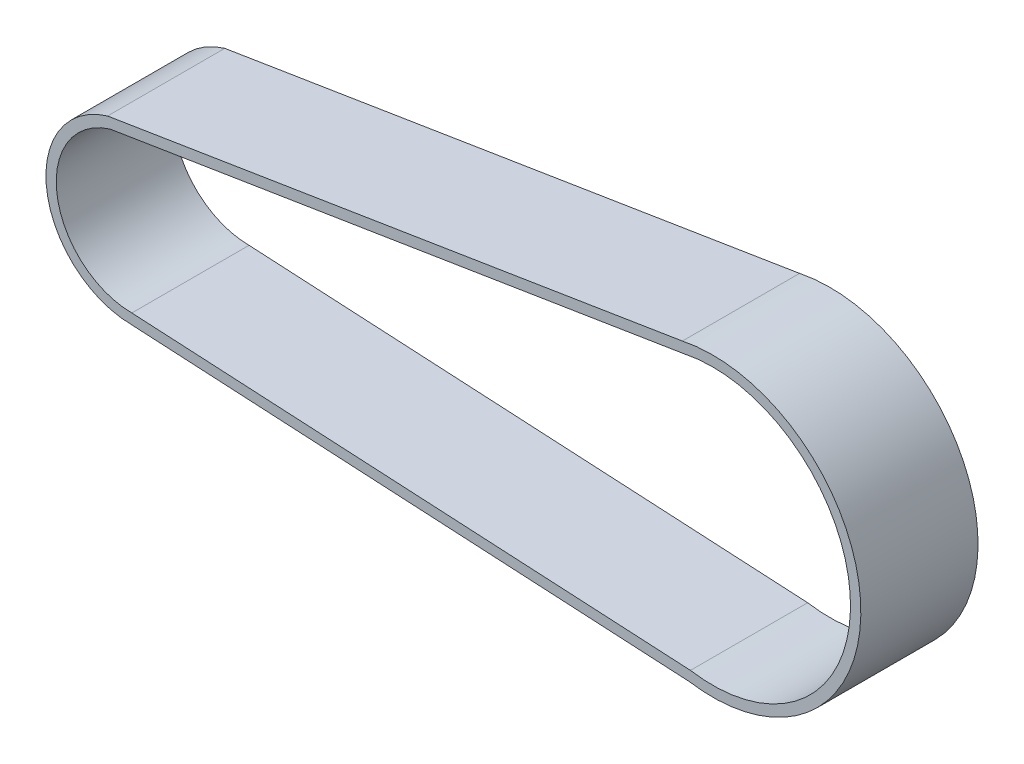
ISO-10303-21;
HEADER;
FILE_DESCRIPTION(('STEP AP214'),'2;1');
FILE_NAME('part.step','',(''),(''),'','','');
FILE_SCHEMA(('AUTOMOTIVE_DESIGN { 1 0 10303 214 1 1 1 1 }'));
ENDSEC;
DATA;
#1=APPLICATION_CONTEXT('core data for automotive mechanical design processes');
#2=APPLICATION_PROTOCOL_DEFINITION('international standard','automotive_design',2000,#1);
#3=PRODUCT_CONTEXT('',#1,'mechanical');
#4=PRODUCT('Part','Part','',(#3));
#5=PRODUCT_RELATED_PRODUCT_CATEGORY('part','',(#4));
#6=PRODUCT_DEFINITION_FORMATION('','',#4);
#7=PRODUCT_DEFINITION_CONTEXT('part definition',#1,'design');
#8=PRODUCT_DEFINITION('design','',#6,#7);
#9=PRODUCT_DEFINITION_SHAPE('','',#8);
#10=(LENGTH_UNIT() NAMED_UNIT(*) SI_UNIT(.MILLI.,.METRE.));
#11=(NAMED_UNIT(*) PLANE_ANGLE_UNIT() SI_UNIT($,.RADIAN.));
#12=(NAMED_UNIT(*) SI_UNIT($,.STERADIAN.) SOLID_ANGLE_UNIT());
#13=UNCERTAINTY_MEASURE_WITH_UNIT(LENGTH_MEASURE(1.E-05),#10,'distance_accuracy_value','');
#14=(GEOMETRIC_REPRESENTATION_CONTEXT(3) GLOBAL_UNCERTAINTY_ASSIGNED_CONTEXT((#13)) GLOBAL_UNIT_ASSIGNED_CONTEXT((#10,
#11,#12)) REPRESENTATION_CONTEXT('',''));
#15=CARTESIAN_POINT('',(0.,0.,0.));
#16=DIRECTION('',(0.,0.,1.));
#17=DIRECTION('',(1.,0.,0.));
#18=AXIS2_PLACEMENT_3D('',#15,#16,#17);
#19=CARTESIAN_POINT('',(0.,0.,17.));
#20=DIRECTION('',(0.,0.,1.));
#21=DIRECTION('',(1.,0.,0.));
#22=AXIS2_PLACEMENT_3D('',#19,#20,#21);
#23=PLANE('',#22);
#24=CARTESIAN_POINT('',(0.,0.,17.));
#25=DIRECTION('',(0.,0.,1.));
#26=DIRECTION('',(1.,0.,0.));
#27=AXIS2_PLACEMENT_3D('',#24,#25,#26);
#28=CIRCLE('',#27,12.5);
#29=CARTESIAN_POINT('',(-3.55275783190881,11.9844862963671,17.));
#30=VERTEX_POINT('',#29);
#31=CARTESIAN_POINT('',(-0.0772820431404437,-12.4997610971493,17.));
#32=VERTEX_POINT('',#31);
#33=EDGE_CURVE('E153',#30,#32,#28,.T.);
#34=ORIENTED_EDGE('',*,*,#33,.T.);
#35=DIRECTION('',(0.998538908196868,-0.0540374760421542,0.));
#36=VECTOR('',#35,1.);
#37=CARTESIAN_POINT('',(80.8355241245104,-16.878482636086,17.));
#38=LINE('',#37,#36);
#39=CARTESIAN_POINT('',(80.8355241245104,-16.878482636086,17.));
#40=VERTEX_POINT('',#39);
#41=EDGE_CURVE('E157',#32,#40,#38,.T.);
#42=ORIENTED_EDGE('',*,*,#41,.T.);
#43=CARTESIAN_POINT('',(84.2120917299038,4.35471757505055,17.));
#44=DIRECTION('',(0.,0.,1.));
#45=DIRECTION('',(1.,0.,0.));
#46=AXIS2_PLACEMENT_3D('',#43,#44,#45);
#47=CIRCLE('',#46,21.5);
#48=CARTESIAN_POINT('',(79.8218015629542,25.4016972217834,17.));
#49=VERTEX_POINT('',#48);
#50=EDGE_CURVE('E161',#40,#49,#47,.T.);
#51=ORIENTED_EDGE('',*,*,#50,.T.);
#52=DIRECTION('',(-0.987297460532367,-0.158882737974707,0.));
#53=VECTOR('',#52,1.);
#54=CARTESIAN_POINT('',(-3.55275783190881,11.9844862963671,17.));
#55=LINE('',#54,#53);
#56=EDGE_CURVE('E164',#49,#30,#55,.T.);
#57=ORIENTED_EDGE('',*,*,#56,.T.);
#58=EDGE_LOOP('',(#34,#42,#51,#57));
#59=FACE_BOUND('',#58,.T.);
#60=DIRECTION('',(0.998538908196868,-0.0540374760421542,0.));
#61=VECTOR('',#60,1.);
#62=CARTESIAN_POINT('',(80.9956736736837,-15.3849545318417,17.));
#63=LINE('',#62,#61);
#64=CARTESIAN_POINT('',(-0.0332376226556832,-10.9999497844508,17.));
#65=VERTEX_POINT('',#64);
#66=CARTESIAN_POINT('',(80.9956736736837,-15.3849545318417,17.));
#67=VERTEX_POINT('',#66);
#68=EDGE_CURVE('E114',#65,#67,#63,.T.);
#69=ORIENTED_EDGE('',*,*,#68,.F.);
#70=CARTESIAN_POINT('',(0.,0.,17.));
#71=DIRECTION('',(0.,0.,1.));
#72=DIRECTION('',(1.,0.,0.));
#73=AXIS2_PLACEMENT_3D('',#70,#71,#72);
#74=CIRCLE('',#73,11.);
#75=CARTESIAN_POINT('',(-3.21599107544035,10.5193821778034,17.));
#76=VERTEX_POINT('',#75);
#77=EDGE_CURVE('E105',#76,#65,#74,.T.);
#78=ORIENTED_EDGE('',*,*,#77,.F.);
#79=DIRECTION('',(-0.987297460532367,-0.158882737974706,0.));
#80=VECTOR('',#79,1.);
#81=CARTESIAN_POINT('',(-3.21599107544035,10.5193821778034,17.));
#82=LINE('',#81,#80);
#83=CARTESIAN_POINT('',(80.0948753125657,23.9263431838957,17.));
#84=VERTEX_POINT('',#83);
#85=EDGE_CURVE('E131',#84,#76,#82,.T.);
#86=ORIENTED_EDGE('',*,*,#85,.F.);
#87=CARTESIAN_POINT('',(84.2120917299038,4.35471757505055,17.));
#88=DIRECTION('',(0.,0.,1.));
#89=DIRECTION('',(1.,0.,0.));
#90=AXIS2_PLACEMENT_3D('',#87,#88,#89);
#91=CIRCLE('',#90,20.);
#92=EDGE_CURVE('E127',#67,#84,#91,.T.);
#93=ORIENTED_EDGE('',*,*,#92,.F.);
#94=EDGE_LOOP('',(#69,#78,#86,#93));
#95=FACE_BOUND('',#94,.T.);
#96=ADVANCED_FACE('F39',(#59,#95),#23,.T.);
#97=CARTESIAN_POINT('',(0.,0.,0.));
#98=DIRECTION('',(0.,0.,1.));
#99=DIRECTION('',(1.,0.,0.));
#100=AXIS2_PLACEMENT_3D('',#97,#98,#99);
#101=PLANE('',#100);
#102=CARTESIAN_POINT('',(0.,0.,0.));
#103=DIRECTION('',(0.,0.,1.));
#104=DIRECTION('',(1.,0.,0.));
#105=AXIS2_PLACEMENT_3D('',#102,#103,#104);
#106=CIRCLE('',#105,12.5);
#107=CARTESIAN_POINT('',(-3.55275783190881,11.9844862963671,0.));
#108=VERTEX_POINT('',#107);
#109=CARTESIAN_POINT('',(-0.0772820431404437,-12.4997610971493,0.));
#110=VERTEX_POINT('',#109);
#111=EDGE_CURVE('E123',#108,#110,#106,.T.);
#112=ORIENTED_EDGE('',*,*,#111,.F.);
#113=DIRECTION('',(-0.987297460532367,-0.158882737974707,0.));
#114=VECTOR('',#113,1.);
#115=CARTESIAN_POINT('',(-3.55275783190881,11.9844862963671,0.));
#116=LINE('',#115,#114);
#117=CARTESIAN_POINT('',(79.8218015629542,25.4016972217834,0.));
#118=VERTEX_POINT('',#117);
#119=EDGE_CURVE('E158',#118,#108,#116,.T.);
#120=ORIENTED_EDGE('',*,*,#119,.F.);
#121=CARTESIAN_POINT('',(84.2120917299038,4.35471757505055,0.));
#122=DIRECTION('',(0.,0.,1.));
#123=DIRECTION('',(1.,0.,0.));
#124=AXIS2_PLACEMENT_3D('',#121,#122,#123);
#125=CIRCLE('',#124,21.5);
#126=CARTESIAN_POINT('',(80.8355241245104,-16.878482636086,0.));
#127=VERTEX_POINT('',#126);
#128=EDGE_CURVE('E174',#127,#118,#125,.T.);
#129=ORIENTED_EDGE('',*,*,#128,.F.);
#130=DIRECTION('',(0.998538908196868,-0.0540374760421542,0.));
#131=VECTOR('',#130,1.);
#132=CARTESIAN_POINT('',(80.8355241245104,-16.878482636086,0.));
#133=LINE('',#132,#131);
#134=EDGE_CURVE('E171',#110,#127,#133,.T.);
#135=ORIENTED_EDGE('',*,*,#134,.F.);
#136=EDGE_LOOP('',(#112,#120,#129,#135));
#137=FACE_BOUND('',#136,.T.);
#138=CARTESIAN_POINT('',(0.,0.,0.));
#139=DIRECTION('',(0.,0.,1.));
#140=DIRECTION('',(1.,0.,0.));
#141=AXIS2_PLACEMENT_3D('',#138,#139,#140);
#142=CIRCLE('',#141,11.);
#143=CARTESIAN_POINT('',(-3.21599107544035,10.5193821778034,0.));
#144=VERTEX_POINT('',#143);
#145=CARTESIAN_POINT('',(-0.0332376226556832,-10.9999497844508,0.));
#146=VERTEX_POINT('',#145);
#147=EDGE_CURVE('E63',#144,#146,#142,.T.);
#148=ORIENTED_EDGE('',*,*,#147,.T.);
#149=DIRECTION('',(0.998538908196868,-0.0540374760421542,0.));
#150=VECTOR('',#149,1.);
#151=CARTESIAN_POINT('',(80.9956736736837,-15.3849545318417,0.));
#152=LINE('',#151,#150);
#153=CARTESIAN_POINT('',(80.9956736736837,-15.3849545318417,0.));
#154=VERTEX_POINT('',#153);
#155=EDGE_CURVE('E121',#146,#154,#152,.T.);
#156=ORIENTED_EDGE('',*,*,#155,.T.);
#157=CARTESIAN_POINT('',(84.2120917299038,4.35471757505055,0.));
#158=DIRECTION('',(0.,0.,1.));
#159=DIRECTION('',(1.,0.,0.));
#160=AXIS2_PLACEMENT_3D('',#157,#158,#159);
#161=CIRCLE('',#160,20.);
#162=CARTESIAN_POINT('',(80.0948753125657,23.9263431838957,0.));
#163=VERTEX_POINT('',#162);
#164=EDGE_CURVE('E140',#154,#163,#161,.T.);
#165=ORIENTED_EDGE('',*,*,#164,.T.);
#166=DIRECTION('',(-0.987297460532367,-0.158882737974706,0.));
#167=VECTOR('',#166,1.);
#168=CARTESIAN_POINT('',(-3.21599107544035,10.5193821778034,0.));
#169=LINE('',#168,#167);
#170=EDGE_CURVE('E115',#163,#144,#169,.T.);
#171=ORIENTED_EDGE('',*,*,#170,.T.);
#172=EDGE_LOOP('',(#148,#156,#165,#171));
#173=FACE_BOUND('',#172,.T.);
#174=ADVANCED_FACE('F197',(#137,#173),#101,.F.);
#175=CARTESIAN_POINT('',(0.,0.,17.));
#176=DIRECTION('',(0.,0.,-1.));
#177=DIRECTION('',(-1.,0.,0.));
#178=AXIS2_PLACEMENT_3D('',#175,#176,#177);
#179=CYLINDRICAL_SURFACE('',#178,12.5);
#180=ORIENTED_EDGE('',*,*,#111,.T.);
#181=DIRECTION('',(0.,0.,-1.));
#182=VECTOR('',#181,1.);
#183=CARTESIAN_POINT('',(-0.0772820431404437,-12.4997610971493,17.));
#184=LINE('',#183,#182);
#185=EDGE_CURVE('E11',#32,#110,#184,.T.);
#186=ORIENTED_EDGE('',*,*,#185,.F.);
#187=ORIENTED_EDGE('',*,*,#33,.F.);
#188=DIRECTION('',(0.,0.,-1.));
#189=VECTOR('',#188,1.);
#190=CARTESIAN_POINT('',(-3.55275783190881,11.9844862963671,17.));
#191=LINE('',#190,#189);
#192=EDGE_CURVE('E167',#30,#108,#191,.T.);
#193=ORIENTED_EDGE('',*,*,#192,.T.);
#194=EDGE_LOOP('',(#180,#186,#187,#193));
#195=FACE_BOUND('',#194,.T.);
#196=ADVANCED_FACE('F41',(#195),#179,.T.);
#197=CARTESIAN_POINT('',(80.8355241245104,-16.878482636086,17.));
#198=DIRECTION('',(0.0540374760421542,0.998538908196868,0.));
#199=DIRECTION('',(-0.998538908196868,0.0540374760421542,0.));
#200=AXIS2_PLACEMENT_3D('',#197,#198,#199);
#201=PLANE('',#200);
#202=ORIENTED_EDGE('',*,*,#134,.T.);
#203=DIRECTION('',(0.,0.,-1.));
#204=VECTOR('',#203,1.);
#205=CARTESIAN_POINT('',(80.8355241245104,-16.878482636086,17.));
#206=LINE('',#205,#204);
#207=EDGE_CURVE('E48',#40,#127,#206,.T.);
#208=ORIENTED_EDGE('',*,*,#207,.F.);
#209=ORIENTED_EDGE('',*,*,#41,.F.);
#210=ORIENTED_EDGE('',*,*,#185,.T.);
#211=EDGE_LOOP('',(#202,#208,#209,#210));
#212=FACE_BOUND('',#211,.T.);
#213=ADVANCED_FACE('F207',(#212),#201,.F.);
#214=CARTESIAN_POINT('',(84.2120917299038,4.35471757505055,17.));
#215=DIRECTION('',(0.,0.,-1.));
#216=DIRECTION('',(-1.,0.,0.));
#217=AXIS2_PLACEMENT_3D('',#214,#215,#216);
#218=CYLINDRICAL_SURFACE('',#217,21.5);
#219=ORIENTED_EDGE('',*,*,#128,.T.);
#220=DIRECTION('',(0.,0.,-1.));
#221=VECTOR('',#220,1.);
#222=CARTESIAN_POINT('',(79.8218015629542,25.4016972217834,17.));
#223=LINE('',#222,#221);
#224=EDGE_CURVE('E182',#49,#118,#223,.T.);
#225=ORIENTED_EDGE('',*,*,#224,.F.);
#226=ORIENTED_EDGE('',*,*,#50,.F.);
#227=ORIENTED_EDGE('',*,*,#207,.T.);
#228=EDGE_LOOP('',(#219,#225,#226,#227));
#229=FACE_BOUND('',#228,.T.);
#230=ADVANCED_FACE('F191',(#229),#218,.T.);
#231=CARTESIAN_POINT('',(-3.55275783190881,11.9844862963671,17.));
#232=DIRECTION('',(0.158882737974707,-0.987297460532367,0.));
#233=DIRECTION('',(0.987297460532367,0.158882737974707,0.));
#234=AXIS2_PLACEMENT_3D('',#231,#232,#233);
#235=PLANE('',#234);
#236=ORIENTED_EDGE('',*,*,#119,.T.);
#237=ORIENTED_EDGE('',*,*,#192,.F.);
#238=ORIENTED_EDGE('',*,*,#56,.F.);
#239=ORIENTED_EDGE('',*,*,#224,.T.);
#240=EDGE_LOOP('',(#236,#237,#238,#239));
#241=FACE_BOUND('',#240,.T.);
#242=ADVANCED_FACE('F201',(#241),#235,.F.);
#243=CARTESIAN_POINT('',(0.,0.,17.));
#244=DIRECTION('',(0.,0.,-1.));
#245=DIRECTION('',(-1.,0.,0.));
#246=AXIS2_PLACEMENT_3D('',#243,#244,#245);
#247=CYLINDRICAL_SURFACE('',#246,11.);
#248=ORIENTED_EDGE('',*,*,#147,.F.);
#249=DIRECTION('',(0.,0.,-1.));
#250=VECTOR('',#249,1.);
#251=CARTESIAN_POINT('',(-3.21599107544035,10.5193821778034,17.));
#252=LINE('',#251,#250);
#253=EDGE_CURVE('E109',#76,#144,#252,.T.);
#254=ORIENTED_EDGE('',*,*,#253,.F.);
#255=ORIENTED_EDGE('',*,*,#77,.T.);
#256=DIRECTION('',(0.,0.,-1.));
#257=VECTOR('',#256,1.);
#258=CARTESIAN_POINT('',(-0.0332376226556832,-10.9999497844508,17.));
#259=LINE('',#258,#257);
#260=EDGE_CURVE('E108',#65,#146,#259,.T.);
#261=ORIENTED_EDGE('',*,*,#260,.T.);
#262=EDGE_LOOP('',(#248,#254,#255,#261));
#263=FACE_BOUND('',#262,.T.);
#264=ADVANCED_FACE('F107',(#263),#247,.F.);
#265=CARTESIAN_POINT('',(80.9956736736837,-15.3849545318417,17.));
#266=DIRECTION('',(0.0540374760421542,0.998538908196868,0.));
#267=DIRECTION('',(-0.998538908196868,0.0540374760421542,0.));
#268=AXIS2_PLACEMENT_3D('',#265,#266,#267);
#269=PLANE('',#268);
#270=ORIENTED_EDGE('',*,*,#155,.F.);
#271=ORIENTED_EDGE('',*,*,#260,.F.);
#272=ORIENTED_EDGE('',*,*,#68,.T.);
#273=DIRECTION('',(0.,0.,-1.));
#274=VECTOR('',#273,1.);
#275=CARTESIAN_POINT('',(80.9956736736837,-15.3849545318417,17.));
#276=LINE('',#275,#274);
#277=EDGE_CURVE('E124',#67,#154,#276,.T.);
#278=ORIENTED_EDGE('',*,*,#277,.T.);
#279=EDGE_LOOP('',(#270,#271,#272,#278));
#280=FACE_BOUND('',#279,.T.);
#281=ADVANCED_FACE('F118',(#280),#269,.T.);
#282=CARTESIAN_POINT('',(84.2120917299038,4.35471757505055,17.));
#283=DIRECTION('',(0.,0.,-1.));
#284=DIRECTION('',(-1.,0.,0.));
#285=AXIS2_PLACEMENT_3D('',#282,#283,#284);
#286=CYLINDRICAL_SURFACE('',#285,20.);
#287=ORIENTED_EDGE('',*,*,#164,.F.);
#288=ORIENTED_EDGE('',*,*,#277,.F.);
#289=ORIENTED_EDGE('',*,*,#92,.T.);
#290=DIRECTION('',(0.,0.,-1.));
#291=VECTOR('',#290,1.);
#292=CARTESIAN_POINT('',(80.0948753125657,23.9263431838957,17.));
#293=LINE('',#292,#291);
#294=EDGE_CURVE('E55',#84,#163,#293,.T.);
#295=ORIENTED_EDGE('',*,*,#294,.T.);
#296=EDGE_LOOP('',(#287,#288,#289,#295));
#297=FACE_BOUND('',#296,.T.);
#298=ADVANCED_FACE('F230',(#297),#286,.F.);
#299=CARTESIAN_POINT('',(-3.21599107544035,10.5193821778034,17.));
#300=DIRECTION('',(0.158882737974706,-0.987297460532367,0.));
#301=DIRECTION('',(0.987297460532367,0.158882737974706,0.));
#302=AXIS2_PLACEMENT_3D('',#299,#300,#301);
#303=PLANE('',#302);
#304=ORIENTED_EDGE('',*,*,#170,.F.);
#305=ORIENTED_EDGE('',*,*,#294,.F.);
#306=ORIENTED_EDGE('',*,*,#85,.T.);
#307=ORIENTED_EDGE('',*,*,#253,.T.);
#308=EDGE_LOOP('',(#304,#305,#306,#307));
#309=FACE_BOUND('',#308,.T.);
#310=ADVANCED_FACE('F234',(#309),#303,.T.);
#311=CLOSED_SHELL('',(#96,#174,#196,#213,#230,#242,#264,#281,#298,#310));
#312=MANIFOLD_SOLID_BREP('B2',#311);
#313=ADVANCED_BREP_SHAPE_REPRESENTATION('',(#18,#312),#14);
#314=SHAPE_DEFINITION_REPRESENTATION(#9,#313);
ENDSEC;
END-ISO-10303-21;
